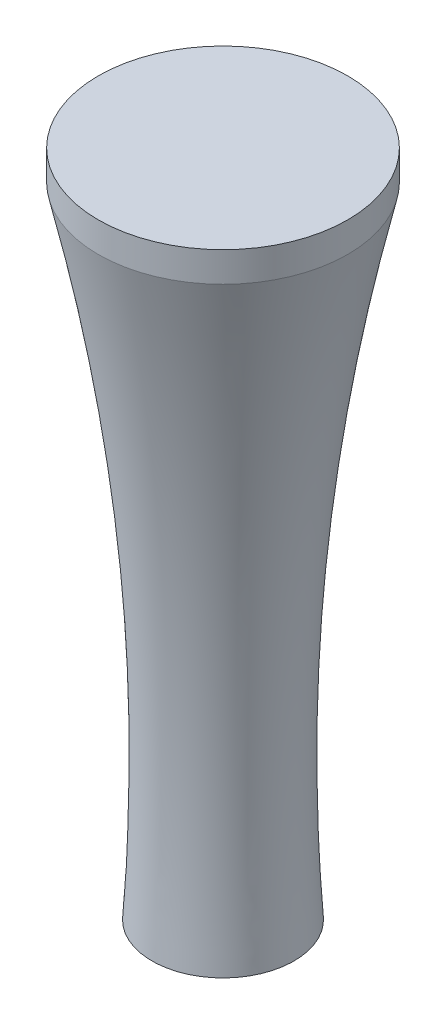
ISO-10303-21;
HEADER;
FILE_DESCRIPTION(('STEP AP214'),'2;1');
FILE_NAME('part.step','',(''),(''),'','','');
FILE_SCHEMA(('AUTOMOTIVE_DESIGN { 1 0 10303 214 1 1 1 1 }'));
ENDSEC;
DATA;
#1=APPLICATION_CONTEXT('core data for automotive mechanical design processes');
#2=APPLICATION_PROTOCOL_DEFINITION('international standard','automotive_design',2000,#1);
#3=PRODUCT_CONTEXT('',#1,'mechanical');
#4=PRODUCT('Part','Part','',(#3));
#5=PRODUCT_RELATED_PRODUCT_CATEGORY('part','',(#4));
#6=PRODUCT_DEFINITION_FORMATION('','',#4);
#7=PRODUCT_DEFINITION_CONTEXT('part definition',#1,'design');
#8=PRODUCT_DEFINITION('design','',#6,#7);
#9=PRODUCT_DEFINITION_SHAPE('','',#8);
#10=(LENGTH_UNIT() NAMED_UNIT(*) SI_UNIT(.MILLI.,.METRE.));
#11=(NAMED_UNIT(*) PLANE_ANGLE_UNIT() SI_UNIT($,.RADIAN.));
#12=(NAMED_UNIT(*) SI_UNIT($,.STERADIAN.) SOLID_ANGLE_UNIT());
#13=UNCERTAINTY_MEASURE_WITH_UNIT(LENGTH_MEASURE(1.E-05),#10,'distance_accuracy_value','');
#14=(GEOMETRIC_REPRESENTATION_CONTEXT(3) GLOBAL_UNCERTAINTY_ASSIGNED_CONTEXT((#13)) GLOBAL_UNIT_ASSIGNED_CONTEXT((#10,
#11,#12)) REPRESENTATION_CONTEXT('',''));
#15=CARTESIAN_POINT('',(0.,0.,0.));
#16=DIRECTION('',(0.,0.,1.));
#17=DIRECTION('',(1.,0.,0.));
#18=AXIS2_PLACEMENT_3D('',#15,#16,#17);
#19=CARTESIAN_POINT('',(-6.35,-2.54,0.));
#20=DIRECTION('',(0.,1.,0.));
#21=DIRECTION('',(0.,0.,1.));
#22=AXIS2_PLACEMENT_3D('',#19,#20,#21);
#23=PLANE('',#22);
#24=CARTESIAN_POINT('',(0.,-2.54,0.));
#25=DIRECTION('',(0.,-1.,0.));
#26=DIRECTION('',(0.,0.,-1.));
#27=AXIS2_PLACEMENT_3D('',#24,#25,#26);
#28=CIRCLE('',#27,9.04071620765278);
#29=CARTESIAN_POINT('',(0.,-2.54,-9.04071620765278));
#30=VERTEX_POINT('',#29);
#31=EDGE_CURVE('E43',#30,#30,#28,.T.);
#32=ORIENTED_EDGE('',*,*,#31,.T.);
#33=EDGE_LOOP('',(#32));
#34=FACE_BOUND('',#33,.T.);
#35=ADVANCED_FACE('F32',(#34),#23,.F.);
#36=CARTESIAN_POINT('',(-15.8730256178983,78.74,0.));
#37=CARTESIAN_POINT('',(-15.6814379157042,77.8860794559291,0.));
#38=CARTESIAN_POINT('',(-15.48985021351,77.0321589118582,0.));
#39=CARTESIAN_POINT('',(-15.1066748091217,75.3243178237164,0.));
#40=CARTESIAN_POINT('',(-14.918577650557,74.4806549483434,0.));
#41=CARTESIAN_POINT('',(-14.3679164206239,71.9413676944091,0.));
#42=CARTESIAN_POINT('',(-13.3148101716234,66.8630325788103,0.));
#43=CARTESIAN_POINT('',(-12.4063108124764,61.7853611339801,0.));
#44=CARTESIAN_POINT('',(-10.7820235939721,51.6307408092209,0.));
#45=CARTESIAN_POINT('',(-9.95610741277516,44.8619615637233,0.));
#46=CARTESIAN_POINT('',(-8.81777966500929,31.3253494105274,0.));
#47=CARTESIAN_POINT('',(-8.50536685438467,24.5575137141918,0.));
#48=CARTESIAN_POINT('',(-8.42176134351178,14.4056490176374,0.));
#49=CARTESIAN_POINT('',(-8.47621488971342,9.32968810248212,0.));
#50=CARTESIAN_POINT('',(-8.69162847736444,3.8305153946411,0.));
#51=CARTESIAN_POINT('',(-8.79954938352862,1.7154011435149,0.));
#52=CARTESIAN_POINT('',(-8.84472335005076,0.869351353180365,0.));
#53=CARTESIAN_POINT('',(-8.8683158228966,0.44915697083226,0.));
#54=CARTESIAN_POINT('',(-8.94220170207782,-0.83191030238155,0.));
#55=CARTESIAN_POINT('',(-8.9914589548653,-1.68595515119077,0.));
#56=CARTESIAN_POINT('',(-9.04071620765278,-2.53999999999998,0.));
#57=B_SPLINE_CURVE_WITH_KNOTS('',3,(#36,#37,#38,#39,#40,#41,#42,#43,#44,#45,#46,#47,#48,#49,#50,
#51,#52,#53,#54,#55,#56),.UNSPECIFIED.,.F.,.F.,(4,2,2,1,2,2,2,1,1,2,2,4),(0.,0.03125,
0.0624999999999999,0.125,0.25,0.5,0.75,0.875,0.9375,0.953125,0.96875,1.),.UNSPECIFIED.);
#58=CARTESIAN_POINT('',(0.,0.,0.));
#59=DIRECTION('',(0.,-1.,0.));
#60=AXIS1_PLACEMENT('',#58,#59);
#61=SURFACE_OF_REVOLUTION('',#57,#60);
#62=ORIENTED_EDGE('',*,*,#31,.F.);
#63=EDGE_LOOP('',(#62));
#64=FACE_BOUND('',#63,.T.);
#65=CARTESIAN_POINT('',(0.,78.74,0.));
#66=DIRECTION('',(0.,1.,0.));
#67=DIRECTION('',(0.,0.,1.));
#68=AXIS2_PLACEMENT_3D('',#65,#66,#67);
#69=CIRCLE('',#68,15.8730256178983);
#70=CARTESIAN_POINT('',(0.,78.74,-15.8730256178983));
#71=VERTEX_POINT('',#70);
#72=EDGE_CURVE('E119',#71,#71,#69,.T.);
#73=ORIENTED_EDGE('',*,*,#72,.F.);
#74=EDGE_LOOP('',(#73));
#75=FACE_BOUND('',#74,.T.);
#76=ADVANCED_FACE('F62',(#64,#75),#61,.T.);
#77=CARTESIAN_POINT('',(0.,82.55,0.));
#78=DIRECTION('',(0.,-1.,0.));
#79=DIRECTION('',(0.,0.,-1.));
#80=AXIS2_PLACEMENT_3D('',#77,#78,#79);
#81=CYLINDRICAL_SURFACE('',#80,15.8730256178983);
#82=CARTESIAN_POINT('',(0.,82.55,0.));
#83=DIRECTION('',(0.,1.,0.));
#84=DIRECTION('',(0.,0.,1.));
#85=AXIS2_PLACEMENT_3D('',#82,#83,#84);
#86=CIRCLE('',#85,15.8730256178983);
#87=CARTESIAN_POINT('',(0.,82.55,-15.8730256178983));
#88=VERTEX_POINT('',#87);
#89=EDGE_CURVE('E47',#88,#88,#86,.T.);
#90=CARTESIAN_POINT('',(0.,82.55,-15.8730256178983));
#91=CARTESIAN_POINT('',(0.,82.5103125,-15.8730256178983));
#92=CARTESIAN_POINT('',(0.,82.470625,-15.8730256178983));
#93=CARTESIAN_POINT('',(0.,82.39125,-15.8730256178983));
#94=CARTESIAN_POINT('',(0.,82.3515625,-15.8730256178983));
#95=CARTESIAN_POINT('',(0.,82.2721875,-15.8730256178983));
#96=CARTESIAN_POINT('',(0.,82.2325,-15.8730256178983));
#97=CARTESIAN_POINT('',(0.,82.153125,-15.8730256178983));
#98=CARTESIAN_POINT('',(0.,82.1134375,-15.8730256178983));
#99=CARTESIAN_POINT('',(0.,82.0340625,-15.8730256178983));
#100=CARTESIAN_POINT('',(0.,81.994375,-15.8730256178983));
#101=CARTESIAN_POINT('',(0.,81.915,-15.8730256178983));
#102=CARTESIAN_POINT('',(0.,81.8753125,-15.8730256178983));
#103=CARTESIAN_POINT('',(0.,81.7959375,-15.8730256178983));
#104=CARTESIAN_POINT('',(0.,81.75625,-15.8730256178983));
#105=CARTESIAN_POINT('',(0.,81.676875,-15.8730256178983));
#106=CARTESIAN_POINT('',(0.,81.6371875,-15.8730256178983));
#107=CARTESIAN_POINT('',(0.,81.5578125,-15.8730256178983));
#108=CARTESIAN_POINT('',(0.,81.518125,-15.8730256178983));
#109=CARTESIAN_POINT('',(0.,81.43875,-15.8730256178983));
#110=CARTESIAN_POINT('',(0.,81.3990625,-15.8730256178983));
#111=CARTESIAN_POINT('',(0.,81.3196875,-15.8730256178983));
#112=CARTESIAN_POINT('',(0.,81.28,-15.8730256178983));
#113=CARTESIAN_POINT('',(0.,81.200625,-15.8730256178983));
#114=CARTESIAN_POINT('',(0.,81.1609375,-15.8730256178983));
#115=CARTESIAN_POINT('',(0.,81.0815625,-15.8730256178983));
#116=CARTESIAN_POINT('',(0.,81.041875,-15.8730256178983));
#117=CARTESIAN_POINT('',(0.,80.9625,-15.8730256178983));
#118=CARTESIAN_POINT('',(0.,80.9228125,-15.8730256178983));
#119=CARTESIAN_POINT('',(0.,80.8434375,-15.8730256178983));
#120=CARTESIAN_POINT('',(0.,80.80375,-15.8730256178983));
#121=CARTESIAN_POINT('',(0.,80.724375,-15.8730256178983));
#122=CARTESIAN_POINT('',(0.,80.6846875,-15.8730256178983));
#123=CARTESIAN_POINT('',(0.,80.6053125,-15.8730256178983));
#124=CARTESIAN_POINT('',(0.,80.565625,-15.8730256178983));
#125=CARTESIAN_POINT('',(0.,80.48625,-15.8730256178983));
#126=CARTESIAN_POINT('',(0.,80.4465625,-15.8730256178983));
#127=CARTESIAN_POINT('',(0.,80.3671875,-15.8730256178983));
#128=CARTESIAN_POINT('',(0.,80.3275,-15.8730256178983));
#129=CARTESIAN_POINT('',(0.,80.248125,-15.8730256178983));
#130=CARTESIAN_POINT('',(0.,80.2084375,-15.8730256178983));
#131=CARTESIAN_POINT('',(0.,80.1290625,-15.8730256178983));
#132=CARTESIAN_POINT('',(0.,80.089375,-15.8730256178983));
#133=CARTESIAN_POINT('',(0.,80.01,-15.8730256178983));
#134=CARTESIAN_POINT('',(0.,79.9703125,-15.8730256178983));
#135=CARTESIAN_POINT('',(0.,79.8909375,-15.8730256178983));
#136=CARTESIAN_POINT('',(0.,79.85125,-15.8730256178983));
#137=CARTESIAN_POINT('',(0.,79.771875,-15.8730256178983));
#138=CARTESIAN_POINT('',(0.,79.7321875,-15.8730256178983));
#139=CARTESIAN_POINT('',(0.,79.6528125,-15.8730256178983));
#140=CARTESIAN_POINT('',(0.,79.613125,-15.8730256178983));
#141=CARTESIAN_POINT('',(0.,79.53375,-15.8730256178983));
#142=CARTESIAN_POINT('',(0.,79.4940625,-15.8730256178983));
#143=CARTESIAN_POINT('',(0.,79.4146875,-15.8730256178983));
#144=CARTESIAN_POINT('',(0.,79.375,-15.8730256178983));
#145=CARTESIAN_POINT('',(0.,79.295625,-15.8730256178983));
#146=CARTESIAN_POINT('',(0.,79.2559375,-15.8730256178983));
#147=CARTESIAN_POINT('',(0.,79.1765625,-15.8730256178983));
#148=CARTESIAN_POINT('',(0.,79.136875,-15.8730256178983));
#149=CARTESIAN_POINT('',(0.,79.0575,-15.8730256178983));
#150=CARTESIAN_POINT('',(0.,79.0178125,-15.8730256178983));
#151=CARTESIAN_POINT('',(0.,78.9384375,-15.8730256178983));
#152=CARTESIAN_POINT('',(0.,78.89875,-15.8730256178983));
#153=CARTESIAN_POINT('',(0.,78.819375,-15.8730256178983));
#154=CARTESIAN_POINT('',(0.,78.7796875,-15.8730256178983));
#155=CARTESIAN_POINT('',(0.,78.74,-15.8730256178983));
#156=B_SPLINE_CURVE_WITH_KNOTS('',3,(#90,#91,#92,#93,#94,#95,#96,#97,#98,#99,#100,#101,#102,
#103,#104,#105,#106,#107,#108,#109,#110,#111,#112,#113,#114,#115,#116,#117,#118,#119,#120,#121,
#122,#123,#124,#125,#126,#127,#128,#129,#130,#131,#132,#133,#134,#135,#136,#137,#138,#139,#140,
#141,#142,#143,#144,#145,#146,#147,#148,#149,#150,#151,#152,#153,#154,#155),.UNSPECIFIED.,.F.,
.F.,(4,2,2,2,2,2,2,2,2,2,2,2,2,2,2,2,2,2,2,2,2,2,2,2,2,2,2,2,2,2,2,2,4),(0.,0.119062500000003,
0.238125000000006,0.357187500000009,0.476250000000011,0.5953125,0.714375000000003,
0.833437500000006,0.952500000000009,1.07156250000001,1.190625,1.3096875,1.42875000000001,
1.54781250000001,1.666875,1.7859375,1.905,2.02406250000001,2.14312500000001,2.2621875,2.38125,
2.5003125,2.61937500000001,2.7384375,2.8575,2.9765625,3.095625,3.21468750000001,3.33375,
3.4528125,3.571875,3.6909375,3.81000000000001),.UNSPECIFIED.);
#157=EDGE_CURVE('BSEAM66',#88,#71,#156,.T.);
#158=ORIENTED_EDGE('',*,*,#89,.F.);
#159=ORIENTED_EDGE('',*,*,#72,.T.);
#160=ORIENTED_EDGE('',*,*,#157,.T.);
#161=ORIENTED_EDGE('',*,*,#157,.F.);
#162=EDGE_LOOP('',(#158,#160,#159,#161));
#163=FACE_BOUND('',#162,.T.);
#164=ADVANCED_FACE('F66',(#163),#81,.T.);
#165=CARTESIAN_POINT('',(0.,82.55,0.));
#166=DIRECTION('',(0.,1.,0.));
#167=DIRECTION('',(0.,0.,1.));
#168=AXIS2_PLACEMENT_3D('',#165,#166,#167);
#169=PLANE('',#168);
#170=ORIENTED_EDGE('',*,*,#89,.T.);
#171=EDGE_LOOP('',(#170));
#172=FACE_BOUND('',#171,.T.);
#173=ADVANCED_FACE('F85',(#172),#169,.T.);
#174=CLOSED_SHELL('',(#35,#76,#164,#173));
#175=CARTESIAN_POINT('',(-6.35,0.,0.));
#176=DIRECTION('',(0.,1.,0.));
#177=DIRECTION('',(0.,0.,1.));
#178=AXIS2_PLACEMENT_3D('',#175,#176,#177);
#179=PLANE('',#178);
#180=CARTESIAN_POINT('',(0.,0.,0.));
#181=DIRECTION('',(0.,-1.,0.));
#182=DIRECTION('',(0.,0.,-1.));
#183=AXIS2_PLACEMENT_3D('',#180,#181,#182);
#184=CIRCLE('',#183,6.35);
#185=CARTESIAN_POINT('',(0.,0.,-6.35));
#186=VERTEX_POINT('',#185);
#187=EDGE_CURVE('E10',#186,#186,#184,.T.);
#188=ORIENTED_EDGE('',*,*,#187,.F.);
#189=EDGE_LOOP('',(#188));
#190=FACE_BOUND('',#189,.T.);
#191=ADVANCED_FACE('F75',(#190),#179,.T.);
#192=CARTESIAN_POINT('',(-12.7,76.2,0.));
#193=CARTESIAN_POINT('',(-4.15241293058248,38.1027728960724,0.));
#194=CARTESIAN_POINT('',(-6.35,0.,0.));
#195=B_SPLINE_CURVE_WITH_KNOTS('',2,(#192,#193,#194),.UNSPECIFIED.,.F.,.F.,(3,3),(0.,
0.851349705696265),.UNSPECIFIED.);
#196=CARTESIAN_POINT('',(0.,0.,0.));
#197=DIRECTION('',(0.,-1.,0.));
#198=AXIS1_PLACEMENT('',#196,#197);
#199=SURFACE_OF_REVOLUTION('',#195,#198);
#200=ORIENTED_EDGE('',*,*,#187,.T.);
#201=EDGE_LOOP('',(#200));
#202=FACE_BOUND('',#201,.T.);
#203=CARTESIAN_POINT('',(0.,76.2,0.));
#204=DIRECTION('',(0.,-1.,0.));
#205=DIRECTION('',(0.,0.,-1.));
#206=AXIS2_PLACEMENT_3D('',#203,#204,#205);
#207=CIRCLE('',#206,12.7);
#208=CARTESIAN_POINT('',(0.,76.2,-12.7));
#209=VERTEX_POINT('',#208);
#210=EDGE_CURVE('E39',#209,#209,#207,.T.);
#211=ORIENTED_EDGE('',*,*,#210,.F.);
#212=EDGE_LOOP('',(#211));
#213=FACE_BOUND('',#212,.T.);
#214=ADVANCED_FACE('F72',(#202,#213),#199,.F.);
#215=CARTESIAN_POINT('',(0.,76.2,0.));
#216=DIRECTION('',(0.,-1.,0.));
#217=DIRECTION('',(0.,0.,-1.));
#218=AXIS2_PLACEMENT_3D('',#215,#216,#217);
#219=PLANE('',#218);
#220=ORIENTED_EDGE('',*,*,#210,.T.);
#221=EDGE_LOOP('',(#220));
#222=FACE_BOUND('',#221,.T.);
#223=ADVANCED_FACE('F69',(#222),#219,.T.);
#224=CLOSED_SHELL('',(#191,#214,#223));
#225=ORIENTED_CLOSED_SHELL('',*,#224,.T.);
#226=BREP_WITH_VOIDS('B2',#174,(#225));
#227=ADVANCED_BREP_SHAPE_REPRESENTATION('',(#18,#226),#14);
#228=SHAPE_DEFINITION_REPRESENTATION(#9,#227);
ENDSEC;
END-ISO-10303-21;
